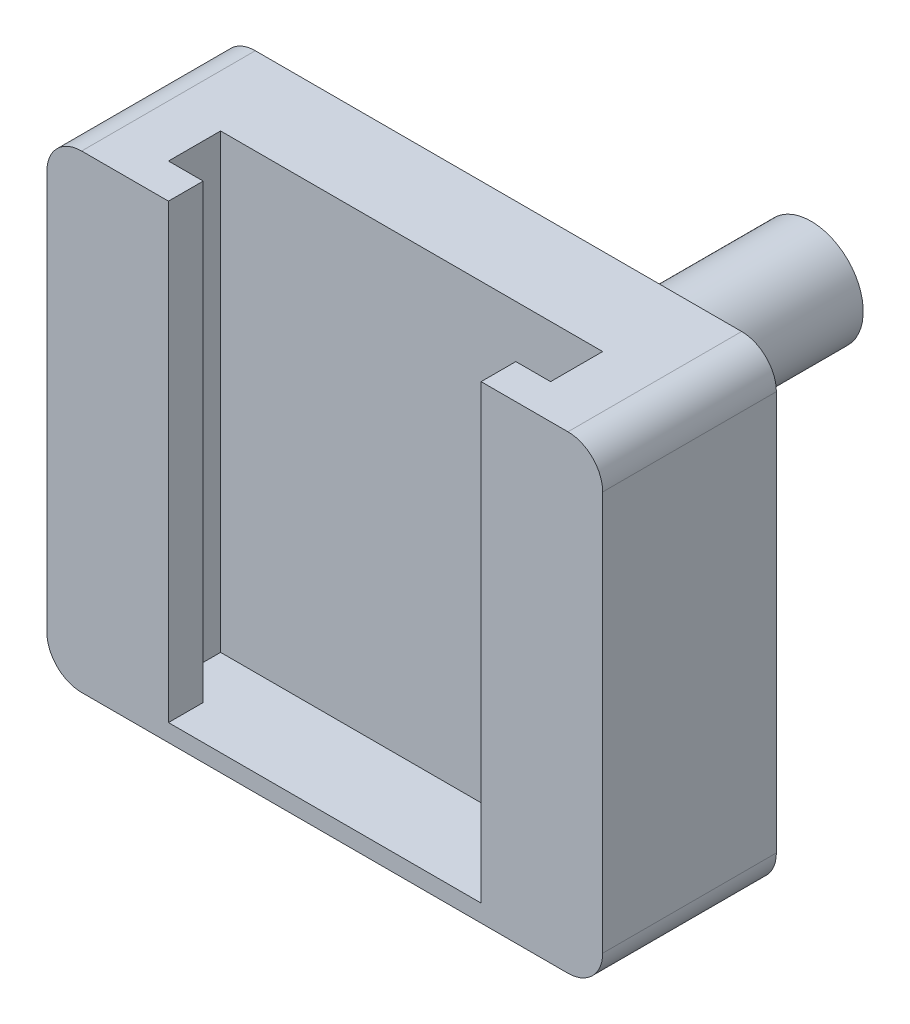
ISO-10303-21;
HEADER;
FILE_DESCRIPTION(('STEP AP214'),'2;1');
FILE_NAME('part.step','',(''),(''),'','','');
FILE_SCHEMA(('AUTOMOTIVE_DESIGN { 1 0 10303 214 1 1 1 1 }'));
ENDSEC;
DATA;
#1=APPLICATION_CONTEXT('core data for automotive mechanical design processes');
#2=APPLICATION_PROTOCOL_DEFINITION('international standard','automotive_design',2000,#1);
#3=PRODUCT_CONTEXT('',#1,'mechanical');
#4=PRODUCT('Part','Part','',(#3));
#5=PRODUCT_RELATED_PRODUCT_CATEGORY('part','',(#4));
#6=PRODUCT_DEFINITION_FORMATION('','',#4);
#7=PRODUCT_DEFINITION_CONTEXT('part definition',#1,'design');
#8=PRODUCT_DEFINITION('design','',#6,#7);
#9=PRODUCT_DEFINITION_SHAPE('','',#8);
#10=(LENGTH_UNIT() NAMED_UNIT(*) SI_UNIT(.MILLI.,.METRE.));
#11=(NAMED_UNIT(*) PLANE_ANGLE_UNIT() SI_UNIT($,.RADIAN.));
#12=(NAMED_UNIT(*) SI_UNIT($,.STERADIAN.) SOLID_ANGLE_UNIT());
#13=UNCERTAINTY_MEASURE_WITH_UNIT(LENGTH_MEASURE(1.E-05),#10,'distance_accuracy_value','');
#14=(GEOMETRIC_REPRESENTATION_CONTEXT(3) GLOBAL_UNCERTAINTY_ASSIGNED_CONTEXT((#13)) GLOBAL_UNIT_ASSIGNED_CONTEXT((#10,
#11,#12)) REPRESENTATION_CONTEXT('',''));
#15=CARTESIAN_POINT('',(0.,0.,0.));
#16=DIRECTION('',(0.,0.,1.));
#17=DIRECTION('',(1.,0.,0.));
#18=AXIS2_PLACEMENT_3D('',#15,#16,#17);
#19=CARTESIAN_POINT('',(0.,0.,10.));
#20=DIRECTION('',(0.,0.,-1.));
#21=DIRECTION('',(-1.,0.,0.));
#22=AXIS2_PLACEMENT_3D('',#19,#20,#21);
#23=PLANE('',#22);
#24=DIRECTION('',(0.,1.,0.));
#25=VECTOR('',#24,1.);
#26=CARTESIAN_POINT('',(9.,-36.061028345357,10.));
#27=LINE('',#26,#25);
#28=CARTESIAN_POINT('',(9.,-12.5000000000001,10.));
#29=VERTEX_POINT('',#28);
#30=CARTESIAN_POINT('',(9.,13.5,10.));
#31=VERTEX_POINT('',#30);
#32=EDGE_CURVE('E159',#29,#31,#27,.T.);
#33=ORIENTED_EDGE('',*,*,#32,.F.);
#34=DIRECTION('',(-1.,0.,0.));
#35=VECTOR('',#34,1.);
#36=CARTESIAN_POINT('',(-9.,-12.5000000000001,10.));
#37=LINE('',#36,#35);
#38=CARTESIAN_POINT('',(-9.,-12.5000000000001,10.));
#39=VERTEX_POINT('',#38);
#40=EDGE_CURVE('E339',#29,#39,#37,.T.);
#41=ORIENTED_EDGE('',*,*,#40,.T.);
#42=DIRECTION('',(0.,1.,0.));
#43=VECTOR('',#42,1.);
#44=CARTESIAN_POINT('',(-9.,-36.061028345357,10.));
#45=LINE('',#44,#43);
#46=CARTESIAN_POINT('',(-9.,13.5,10.));
#47=VERTEX_POINT('',#46);
#48=EDGE_CURVE('E57',#39,#47,#45,.T.);
#49=ORIENTED_EDGE('',*,*,#48,.T.);
#50=DIRECTION('',(1.,0.,0.));
#51=VECTOR('',#50,1.);
#52=CARTESIAN_POINT('',(-15.9999999999999,13.5,10.));
#53=LINE('',#52,#51);
#54=CARTESIAN_POINT('',(-13.9999999999999,13.5,10.));
#55=VERTEX_POINT('',#54);
#56=EDGE_CURVE('E177',#55,#47,#53,.T.);
#57=ORIENTED_EDGE('',*,*,#56,.F.);
#58=CARTESIAN_POINT('',(-13.9999999999999,11.5,10.));
#59=DIRECTION('',(0.,0.,-1.));
#60=DIRECTION('',(-1.,0.,0.));
#61=AXIS2_PLACEMENT_3D('',#58,#59,#60);
#62=CIRCLE('',#61,2.);
#63=CARTESIAN_POINT('',(-15.9999999999999,11.5,10.));
#64=VERTEX_POINT('',#63);
#65=EDGE_CURVE('E221',#55,#64,#62,.F.);
#66=ORIENTED_EDGE('',*,*,#65,.T.);
#67=DIRECTION('',(0.,1.,0.));
#68=VECTOR('',#67,1.);
#69=CARTESIAN_POINT('',(-15.9999999999999,-13.5000000000001,10.));
#70=LINE('',#69,#68);
#71=CARTESIAN_POINT('',(-15.9999999999999,-11.5000000000001,10.));
#72=VERTEX_POINT('',#71);
#73=EDGE_CURVE('E179',#72,#64,#70,.T.);
#74=ORIENTED_EDGE('',*,*,#73,.F.);
#75=CARTESIAN_POINT('',(-13.9999999999999,-11.5000000000001,10.));
#76=DIRECTION('',(0.,0.,-1.));
#77=DIRECTION('',(-1.,0.,0.));
#78=AXIS2_PLACEMENT_3D('',#75,#76,#77);
#79=CIRCLE('',#78,2.);
#80=CARTESIAN_POINT('',(-13.9999999999999,-13.5000000000001,10.));
#81=VERTEX_POINT('',#80);
#82=EDGE_CURVE('E222',#72,#81,#79,.F.);
#83=ORIENTED_EDGE('',*,*,#82,.T.);
#84=DIRECTION('',(1.,0.,0.));
#85=VECTOR('',#84,1.);
#86=CARTESIAN_POINT('',(-15.9999999999999,-13.5000000000001,10.));
#87=LINE('',#86,#85);
#88=CARTESIAN_POINT('',(14.0000000000001,-13.5000000000001,10.));
#89=VERTEX_POINT('',#88);
#90=EDGE_CURVE('E188',#81,#89,#87,.T.);
#91=ORIENTED_EDGE('',*,*,#90,.T.);
#92=CARTESIAN_POINT('',(14.0000000000001,-11.5000000000001,10.));
#93=DIRECTION('',(0.,0.,-1.));
#94=DIRECTION('',(-1.,0.,0.));
#95=AXIS2_PLACEMENT_3D('',#92,#93,#94);
#96=CIRCLE('',#95,2.);
#97=CARTESIAN_POINT('',(16.0000000000001,-11.5000000000001,10.));
#98=VERTEX_POINT('',#97);
#99=EDGE_CURVE('E227',#89,#98,#96,.F.);
#100=ORIENTED_EDGE('',*,*,#99,.T.);
#101=DIRECTION('',(0.,1.,0.));
#102=VECTOR('',#101,1.);
#103=CARTESIAN_POINT('',(16.0000000000001,-13.5000000000001,10.));
#104=LINE('',#103,#102);
#105=CARTESIAN_POINT('',(16.0000000000001,11.5,10.));
#106=VERTEX_POINT('',#105);
#107=EDGE_CURVE('E182',#98,#106,#104,.T.);
#108=ORIENTED_EDGE('',*,*,#107,.T.);
#109=CARTESIAN_POINT('',(14.0000000000001,11.5,10.));
#110=DIRECTION('',(0.,0.,-1.));
#111=DIRECTION('',(-1.,0.,0.));
#112=AXIS2_PLACEMENT_3D('',#109,#110,#111);
#113=CIRCLE('',#112,2.);
#114=CARTESIAN_POINT('',(14.0000000000001,13.5,10.));
#115=VERTEX_POINT('',#114);
#116=EDGE_CURVE('E180',#106,#115,#113,.F.);
#117=ORIENTED_EDGE('',*,*,#116,.T.);
#118=EDGE_CURVE('E63',#31,#115,#53,.T.);
#119=ORIENTED_EDGE('',*,*,#118,.F.);
#120=EDGE_LOOP('',(#33,#41,#49,#57,#66,#74,#83,#91,#100,#108,#117,#119));
#121=FACE_BOUND('',#120,.T.);
#122=ADVANCED_FACE('F41',(#121),#23,.F.);
#123=CARTESIAN_POINT('',(-15.9999999999999,-13.5000000000001,10.));
#124=DIRECTION('',(-1.,0.,0.));
#125=DIRECTION('',(0.,0.,1.));
#126=AXIS2_PLACEMENT_3D('',#123,#124,#125);
#127=PLANE('',#126);
#128=DIRECTION('',(0.,1.,0.));
#129=VECTOR('',#128,1.);
#130=CARTESIAN_POINT('',(-15.9999999999999,-13.5000000000001,0.));
#131=LINE('',#130,#129);
#132=CARTESIAN_POINT('',(-15.9999999999999,-11.5000000000001,0.));
#133=VERTEX_POINT('',#132);
#134=CARTESIAN_POINT('',(-15.9999999999999,11.5,0.));
#135=VERTEX_POINT('',#134);
#136=EDGE_CURVE('E193',#133,#135,#131,.T.);
#137=ORIENTED_EDGE('',*,*,#136,.F.);
#138=DIRECTION('',(0.,0.,-1.));
#139=VECTOR('',#138,1.);
#140=CARTESIAN_POINT('',(-15.9999999999999,-11.5000000000001,10.));
#141=LINE('',#140,#139);
#142=EDGE_CURVE('E235',#133,#72,#141,.F.);
#143=ORIENTED_EDGE('',*,*,#142,.T.);
#144=ORIENTED_EDGE('',*,*,#73,.T.);
#145=DIRECTION('',(0.,0.,-1.));
#146=VECTOR('',#145,1.);
#147=CARTESIAN_POINT('',(-15.9999999999999,11.5,10.));
#148=LINE('',#147,#146);
#149=EDGE_CURVE('E230',#64,#135,#148,.T.);
#150=ORIENTED_EDGE('',*,*,#149,.T.);
#151=EDGE_LOOP('',(#137,#143,#144,#150));
#152=FACE_BOUND('',#151,.T.);
#153=ADVANCED_FACE('F251',(#152),#127,.T.);
#154=CARTESIAN_POINT('',(-15.9999999999999,-13.5000000000001,10.));
#155=DIRECTION('',(0.,1.,0.));
#156=DIRECTION('',(0.,0.,1.));
#157=AXIS2_PLACEMENT_3D('',#154,#155,#156);
#158=PLANE('',#157);
#159=DIRECTION('',(1.,0.,0.));
#160=VECTOR('',#159,1.);
#161=CARTESIAN_POINT('',(-15.9999999999999,-13.5000000000001,0.));
#162=LINE('',#161,#160);
#163=CARTESIAN_POINT('',(-13.9999999999999,-13.5000000000001,0.));
#164=VERTEX_POINT('',#163);
#165=CARTESIAN_POINT('',(14.0000000000001,-13.5000000000001,0.));
#166=VERTEX_POINT('',#165);
#167=EDGE_CURVE('E184',#164,#166,#162,.T.);
#168=ORIENTED_EDGE('',*,*,#167,.T.);
#169=DIRECTION('',(0.,0.,-1.));
#170=VECTOR('',#169,1.);
#171=CARTESIAN_POINT('',(14.0000000000001,-13.5000000000001,10.));
#172=LINE('',#171,#170);
#173=EDGE_CURVE('E217',#166,#89,#172,.F.);
#174=ORIENTED_EDGE('',*,*,#173,.T.);
#175=ORIENTED_EDGE('',*,*,#90,.F.);
#176=DIRECTION('',(0.,0.,-1.));
#177=VECTOR('',#176,1.);
#178=CARTESIAN_POINT('',(-13.9999999999999,-13.5000000000001,0.));
#179=LINE('',#178,#177);
#180=EDGE_CURVE('E216',#81,#164,#179,.T.);
#181=ORIENTED_EDGE('',*,*,#180,.T.);
#182=EDGE_LOOP('',(#168,#174,#175,#181));
#183=FACE_BOUND('',#182,.T.);
#184=ADVANCED_FACE('F264',(#183),#158,.F.);
#185=CARTESIAN_POINT('',(16.0000000000001,-13.5000000000001,10.));
#186=DIRECTION('',(-1.,0.,0.));
#187=DIRECTION('',(0.,0.,1.));
#188=AXIS2_PLACEMENT_3D('',#185,#186,#187);
#189=PLANE('',#188);
#190=ORIENTED_EDGE('',*,*,#107,.F.);
#191=DIRECTION('',(0.,0.,-1.));
#192=VECTOR('',#191,1.);
#193=CARTESIAN_POINT('',(16.0000000000001,-11.5000000000001,10.));
#194=LINE('',#193,#192);
#195=CARTESIAN_POINT('',(16.0000000000001,-11.5000000000001,0.));
#196=VERTEX_POINT('',#195);
#197=EDGE_CURVE('E207',#98,#196,#194,.T.);
#198=ORIENTED_EDGE('',*,*,#197,.T.);
#199=DIRECTION('',(0.,1.,0.));
#200=VECTOR('',#199,1.);
#201=CARTESIAN_POINT('',(16.0000000000001,-13.5000000000001,0.));
#202=LINE('',#201,#200);
#203=CARTESIAN_POINT('',(16.0000000000001,11.5,0.));
#204=VERTEX_POINT('',#203);
#205=EDGE_CURVE('E197',#196,#204,#202,.T.);
#206=ORIENTED_EDGE('',*,*,#205,.T.);
#207=DIRECTION('',(0.,0.,-1.));
#208=VECTOR('',#207,1.);
#209=CARTESIAN_POINT('',(16.0000000000001,11.5,10.));
#210=LINE('',#209,#208);
#211=EDGE_CURVE('E195',#204,#106,#210,.F.);
#212=ORIENTED_EDGE('',*,*,#211,.T.);
#213=EDGE_LOOP('',(#190,#198,#206,#212));
#214=FACE_BOUND('',#213,.T.);
#215=ADVANCED_FACE('F274',(#214),#189,.F.);
#216=CARTESIAN_POINT('',(-15.9999999999999,13.5,10.));
#217=DIRECTION('',(0.,1.,0.));
#218=DIRECTION('',(0.,0.,1.));
#219=AXIS2_PLACEMENT_3D('',#216,#217,#218);
#220=PLANE('',#219);
#221=DIRECTION('',(0.,0.,-1.));
#222=VECTOR('',#221,1.);
#223=CARTESIAN_POINT('',(9.,13.5,8.));
#224=LINE('',#223,#222);
#225=CARTESIAN_POINT('',(9.,13.5,8.));
#226=VERTEX_POINT('',#225);
#227=EDGE_CURVE('E158',#31,#226,#224,.T.);
#228=ORIENTED_EDGE('',*,*,#227,.F.);
#229=ORIENTED_EDGE('',*,*,#118,.T.);
#230=DIRECTION('',(0.,0.,-1.));
#231=VECTOR('',#230,1.);
#232=CARTESIAN_POINT('',(14.0000000000001,13.5,0.));
#233=LINE('',#232,#231);
#234=CARTESIAN_POINT('',(14.0000000000001,13.5,0.));
#235=VERTEX_POINT('',#234);
#236=EDGE_CURVE('E236',#115,#235,#233,.T.);
#237=ORIENTED_EDGE('',*,*,#236,.T.);
#238=DIRECTION('',(1.,0.,0.));
#239=VECTOR('',#238,1.);
#240=CARTESIAN_POINT('',(-15.9999999999999,13.5,0.));
#241=LINE('',#240,#239);
#242=CARTESIAN_POINT('',(-13.9999999999999,13.5,0.));
#243=VERTEX_POINT('',#242);
#244=EDGE_CURVE('E196',#243,#235,#241,.T.);
#245=ORIENTED_EDGE('',*,*,#244,.F.);
#246=DIRECTION('',(0.,0.,-1.));
#247=VECTOR('',#246,1.);
#248=CARTESIAN_POINT('',(-13.9999999999999,13.5,10.));
#249=LINE('',#248,#247);
#250=EDGE_CURVE('E234',#243,#55,#249,.F.);
#251=ORIENTED_EDGE('',*,*,#250,.T.);
#252=ORIENTED_EDGE('',*,*,#56,.T.);
#253=DIRECTION('',(0.,0.,1.));
#254=VECTOR('',#253,1.);
#255=CARTESIAN_POINT('',(-9.,13.5,10.));
#256=LINE('',#255,#254);
#257=CARTESIAN_POINT('',(-9.,13.5,8.));
#258=VERTEX_POINT('',#257);
#259=EDGE_CURVE('E170',#258,#47,#256,.T.);
#260=ORIENTED_EDGE('',*,*,#259,.F.);
#261=DIRECTION('',(1.,0.,0.));
#262=VECTOR('',#261,1.);
#263=CARTESIAN_POINT('',(-9.,13.5,8.));
#264=LINE('',#263,#262);
#265=CARTESIAN_POINT('',(-11.,13.5,8.));
#266=VERTEX_POINT('',#265);
#267=EDGE_CURVE('E324',#266,#258,#264,.T.);
#268=ORIENTED_EDGE('',*,*,#267,.F.);
#269=DIRECTION('',(0.,0.,1.));
#270=VECTOR('',#269,1.);
#271=CARTESIAN_POINT('',(-11.,13.5,8.));
#272=LINE('',#271,#270);
#273=CARTESIAN_POINT('',(-11.,13.5,5.));
#274=VERTEX_POINT('',#273);
#275=EDGE_CURVE('E325',#274,#266,#272,.T.);
#276=ORIENTED_EDGE('',*,*,#275,.F.);
#277=DIRECTION('',(-1.,0.,0.));
#278=VECTOR('',#277,1.);
#279=CARTESIAN_POINT('',(-11.,13.5,5.));
#280=LINE('',#279,#278);
#281=CARTESIAN_POINT('',(11.,13.5,5.));
#282=VERTEX_POINT('',#281);
#283=EDGE_CURVE('E347',#282,#274,#280,.T.);
#284=ORIENTED_EDGE('',*,*,#283,.F.);
#285=DIRECTION('',(0.,0.,-1.));
#286=VECTOR('',#285,1.);
#287=CARTESIAN_POINT('',(11.,13.5,5.));
#288=LINE('',#287,#286);
#289=CARTESIAN_POINT('',(11.,13.5,8.));
#290=VERTEX_POINT('',#289);
#291=EDGE_CURVE('E346',#290,#282,#288,.T.);
#292=ORIENTED_EDGE('',*,*,#291,.F.);
#293=DIRECTION('',(1.,0.,0.));
#294=VECTOR('',#293,1.);
#295=CARTESIAN_POINT('',(11.,13.5,8.));
#296=LINE('',#295,#294);
#297=EDGE_CURVE('E175',#226,#290,#296,.T.);
#298=ORIENTED_EDGE('',*,*,#297,.F.);
#299=EDGE_LOOP('',(#228,#229,#237,#245,#251,#252,#260,#268,#276,#284,#292,#298));
#300=FACE_BOUND('',#299,.T.);
#301=ADVANCED_FACE('F169',(#300),#220,.T.);
#302=CARTESIAN_POINT('',(0.,0.,0.));
#303=DIRECTION('',(0.,0.,-1.));
#304=DIRECTION('',(-1.,0.,0.));
#305=AXIS2_PLACEMENT_3D('',#302,#303,#304);
#306=PLANE('',#305);
#307=CARTESIAN_POINT('',(0.,0.,0.));
#308=DIRECTION('',(0.,0.,-1.));
#309=DIRECTION('',(-1.,0.,0.));
#310=AXIS2_PLACEMENT_3D('',#307,#308,#309);
#311=CIRCLE('',#310,5.);
#312=CARTESIAN_POINT('',(-5.,0.,0.));
#313=VERTEX_POINT('',#312);
#314=EDGE_CURVE('E12',#313,#313,#311,.F.);
#315=ORIENTED_EDGE('',*,*,#314,.T.);
#316=EDGE_LOOP('',(#315));
#317=FACE_BOUND('',#316,.T.);
#318=ORIENTED_EDGE('',*,*,#205,.F.);
#319=CARTESIAN_POINT('',(14.0000000000001,-11.5000000000001,0.));
#320=DIRECTION('',(0.,0.,-1.));
#321=DIRECTION('',(-1.,0.,0.));
#322=AXIS2_PLACEMENT_3D('',#319,#320,#321);
#323=CIRCLE('',#322,2.);
#324=EDGE_CURVE('E212',#196,#166,#323,.T.);
#325=ORIENTED_EDGE('',*,*,#324,.T.);
#326=ORIENTED_EDGE('',*,*,#167,.F.);
#327=CARTESIAN_POINT('',(-13.9999999999999,-11.5000000000001,0.));
#328=DIRECTION('',(0.,0.,-1.));
#329=DIRECTION('',(-1.,0.,0.));
#330=AXIS2_PLACEMENT_3D('',#327,#328,#329);
#331=CIRCLE('',#330,2.);
#332=EDGE_CURVE('E215',#164,#133,#331,.T.);
#333=ORIENTED_EDGE('',*,*,#332,.T.);
#334=ORIENTED_EDGE('',*,*,#136,.T.);
#335=CARTESIAN_POINT('',(-13.9999999999999,11.5,0.));
#336=DIRECTION('',(0.,0.,-1.));
#337=DIRECTION('',(-1.,0.,0.));
#338=AXIS2_PLACEMENT_3D('',#335,#336,#337);
#339=CIRCLE('',#338,2.);
#340=EDGE_CURVE('E209',#135,#243,#339,.T.);
#341=ORIENTED_EDGE('',*,*,#340,.T.);
#342=ORIENTED_EDGE('',*,*,#244,.T.);
#343=CARTESIAN_POINT('',(14.0000000000001,11.5,0.));
#344=DIRECTION('',(0.,0.,-1.));
#345=DIRECTION('',(-1.,0.,0.));
#346=AXIS2_PLACEMENT_3D('',#343,#344,#345);
#347=CIRCLE('',#346,2.);
#348=EDGE_CURVE('E214',#235,#204,#347,.T.);
#349=ORIENTED_EDGE('',*,*,#348,.T.);
#350=EDGE_LOOP('',(#318,#325,#326,#333,#334,#341,#342,#349));
#351=FACE_BOUND('',#350,.T.);
#352=ADVANCED_FACE('F266',(#317,#351),#306,.T.);
#353=CARTESIAN_POINT('',(14.0000000000001,-11.5000000000001,10.));
#354=DIRECTION('',(0.,0.,-1.));
#355=DIRECTION('',(-1.,0.,0.));
#356=AXIS2_PLACEMENT_3D('',#353,#354,#355);
#357=CYLINDRICAL_SURFACE('',#356,2.);
#358=ORIENTED_EDGE('',*,*,#99,.F.);
#359=ORIENTED_EDGE('',*,*,#173,.F.);
#360=ORIENTED_EDGE('',*,*,#324,.F.);
#361=ORIENTED_EDGE('',*,*,#197,.F.);
#362=EDGE_LOOP('',(#358,#359,#360,#361));
#363=FACE_BOUND('',#362,.T.);
#364=ADVANCED_FACE('F267',(#363),#357,.T.);
#365=CARTESIAN_POINT('',(-13.9999999999999,-11.5000000000001,10.));
#366=DIRECTION('',(0.,0.,1.));
#367=DIRECTION('',(1.,0.,0.));
#368=AXIS2_PLACEMENT_3D('',#365,#366,#367);
#369=CYLINDRICAL_SURFACE('',#368,2.);
#370=ORIENTED_EDGE('',*,*,#82,.F.);
#371=ORIENTED_EDGE('',*,*,#142,.F.);
#372=ORIENTED_EDGE('',*,*,#332,.F.);
#373=ORIENTED_EDGE('',*,*,#180,.F.);
#374=EDGE_LOOP('',(#370,#371,#372,#373));
#375=FACE_BOUND('',#374,.T.);
#376=ADVANCED_FACE('F281',(#375),#369,.T.);
#377=CARTESIAN_POINT('',(14.0000000000001,11.5,10.));
#378=DIRECTION('',(0.,0.,1.));
#379=DIRECTION('',(1.,0.,0.));
#380=AXIS2_PLACEMENT_3D('',#377,#378,#379);
#381=CYLINDRICAL_SURFACE('',#380,2.);
#382=ORIENTED_EDGE('',*,*,#116,.F.);
#383=ORIENTED_EDGE('',*,*,#211,.F.);
#384=ORIENTED_EDGE('',*,*,#348,.F.);
#385=ORIENTED_EDGE('',*,*,#236,.F.);
#386=EDGE_LOOP('',(#382,#383,#384,#385));
#387=FACE_BOUND('',#386,.T.);
#388=ADVANCED_FACE('F289',(#387),#381,.T.);
#389=CARTESIAN_POINT('',(-13.9999999999999,11.5,10.));
#390=DIRECTION('',(0.,0.,-1.));
#391=DIRECTION('',(-1.,0.,0.));
#392=AXIS2_PLACEMENT_3D('',#389,#390,#391);
#393=CYLINDRICAL_SURFACE('',#392,2.);
#394=ORIENTED_EDGE('',*,*,#65,.F.);
#395=ORIENTED_EDGE('',*,*,#250,.F.);
#396=ORIENTED_EDGE('',*,*,#340,.F.);
#397=ORIENTED_EDGE('',*,*,#149,.F.);
#398=EDGE_LOOP('',(#394,#395,#396,#397));
#399=FACE_BOUND('',#398,.T.);
#400=ADVANCED_FACE('F288',(#399),#393,.T.);
#401=CARTESIAN_POINT('',(-9.,-36.061028345357,10.));
#402=DIRECTION('',(-1.,0.,0.));
#403=DIRECTION('',(0.,0.,1.));
#404=AXIS2_PLACEMENT_3D('',#401,#402,#403);
#405=PLANE('',#404);
#406=DIRECTION('',(0.,0.,-1.));
#407=VECTOR('',#406,1.);
#408=CARTESIAN_POINT('',(-9.,-12.5000000000001,10.));
#409=LINE('',#408,#407);
#410=CARTESIAN_POINT('',(-9.,-12.5000000000001,8.));
#411=VERTEX_POINT('',#410);
#412=EDGE_CURVE('E338',#39,#411,#409,.T.);
#413=ORIENTED_EDGE('',*,*,#412,.T.);
#414=DIRECTION('',(0.,1.,0.));
#415=VECTOR('',#414,1.);
#416=CARTESIAN_POINT('',(-9.,-36.061028345357,8.));
#417=LINE('',#416,#415);
#418=EDGE_CURVE('E328',#411,#258,#417,.T.);
#419=ORIENTED_EDGE('',*,*,#418,.T.);
#420=ORIENTED_EDGE('',*,*,#259,.T.);
#421=ORIENTED_EDGE('',*,*,#48,.F.);
#422=EDGE_LOOP('',(#413,#419,#420,#421));
#423=FACE_BOUND('',#422,.T.);
#424=ADVANCED_FACE('F293',(#423),#405,.F.);
#425=CARTESIAN_POINT('',(-9.,-36.061028345357,8.));
#426=DIRECTION('',(0.,0.,1.));
#427=DIRECTION('',(1.,0.,0.));
#428=AXIS2_PLACEMENT_3D('',#425,#426,#427);
#429=PLANE('',#428);
#430=DIRECTION('',(-1.,0.,0.));
#431=VECTOR('',#430,1.);
#432=CARTESIAN_POINT('',(-9.,-12.5000000000001,8.));
#433=LINE('',#432,#431);
#434=CARTESIAN_POINT('',(-11.,-12.5000000000001,8.));
#435=VERTEX_POINT('',#434);
#436=EDGE_CURVE('E341',#411,#435,#433,.T.);
#437=ORIENTED_EDGE('',*,*,#436,.T.);
#438=DIRECTION('',(0.,1.,0.));
#439=VECTOR('',#438,1.);
#440=CARTESIAN_POINT('',(-11.,-36.061028345357,8.));
#441=LINE('',#440,#439);
#442=EDGE_CURVE('E334',#435,#266,#441,.T.);
#443=ORIENTED_EDGE('',*,*,#442,.T.);
#444=ORIENTED_EDGE('',*,*,#267,.T.);
#445=ORIENTED_EDGE('',*,*,#418,.F.);
#446=EDGE_LOOP('',(#437,#443,#444,#445));
#447=FACE_BOUND('',#446,.T.);
#448=ADVANCED_FACE('F298',(#447),#429,.F.);
#449=CARTESIAN_POINT('',(-11.,-36.061028345357,8.));
#450=DIRECTION('',(-1.,0.,0.));
#451=DIRECTION('',(0.,0.,1.));
#452=AXIS2_PLACEMENT_3D('',#449,#450,#451);
#453=PLANE('',#452);
#454=DIRECTION('',(0.,0.,-1.));
#455=VECTOR('',#454,1.);
#456=CARTESIAN_POINT('',(-11.,-12.5000000000001,8.));
#457=LINE('',#456,#455);
#458=CARTESIAN_POINT('',(-11.,-12.5000000000001,5.));
#459=VERTEX_POINT('',#458);
#460=EDGE_CURVE('E380',#435,#459,#457,.T.);
#461=ORIENTED_EDGE('',*,*,#460,.T.);
#462=DIRECTION('',(0.,1.,0.));
#463=VECTOR('',#462,1.);
#464=CARTESIAN_POINT('',(-11.,-36.061028345357,5.));
#465=LINE('',#464,#463);
#466=EDGE_CURVE('E335',#459,#274,#465,.T.);
#467=ORIENTED_EDGE('',*,*,#466,.T.);
#468=ORIENTED_EDGE('',*,*,#275,.T.);
#469=ORIENTED_EDGE('',*,*,#442,.F.);
#470=EDGE_LOOP('',(#461,#467,#468,#469));
#471=FACE_BOUND('',#470,.T.);
#472=ADVANCED_FACE('F352',(#471),#453,.F.);
#473=CARTESIAN_POINT('',(-11.,-36.061028345357,5.));
#474=DIRECTION('',(0.,0.,-1.));
#475=DIRECTION('',(-1.,0.,0.));
#476=AXIS2_PLACEMENT_3D('',#473,#474,#475);
#477=PLANE('',#476);
#478=DIRECTION('',(1.,0.,0.));
#479=VECTOR('',#478,1.);
#480=CARTESIAN_POINT('',(-11.,-12.5000000000001,5.));
#481=LINE('',#480,#479);
#482=CARTESIAN_POINT('',(11.,-12.5000000000001,5.));
#483=VERTEX_POINT('',#482);
#484=EDGE_CURVE('E365',#459,#483,#481,.T.);
#485=ORIENTED_EDGE('',*,*,#484,.T.);
#486=DIRECTION('',(0.,1.,0.));
#487=VECTOR('',#486,1.);
#488=CARTESIAN_POINT('',(11.,-36.061028345357,5.));
#489=LINE('',#488,#487);
#490=EDGE_CURVE('E332',#483,#282,#489,.T.);
#491=ORIENTED_EDGE('',*,*,#490,.T.);
#492=ORIENTED_EDGE('',*,*,#283,.T.);
#493=ORIENTED_EDGE('',*,*,#466,.F.);
#494=EDGE_LOOP('',(#485,#491,#492,#493));
#495=FACE_BOUND('',#494,.T.);
#496=ADVANCED_FACE('F360',(#495),#477,.F.);
#497=CARTESIAN_POINT('',(11.,-36.061028345357,5.));
#498=DIRECTION('',(1.,0.,0.));
#499=DIRECTION('',(0.,0.,-1.));
#500=AXIS2_PLACEMENT_3D('',#497,#498,#499);
#501=PLANE('',#500);
#502=DIRECTION('',(0.,0.,1.));
#503=VECTOR('',#502,1.);
#504=CARTESIAN_POINT('',(11.,-12.5000000000001,5.));
#505=LINE('',#504,#503);
#506=CARTESIAN_POINT('',(11.,-12.5000000000001,8.));
#507=VERTEX_POINT('',#506);
#508=EDGE_CURVE('E370',#483,#507,#505,.T.);
#509=ORIENTED_EDGE('',*,*,#508,.T.);
#510=DIRECTION('',(0.,1.,0.));
#511=VECTOR('',#510,1.);
#512=CARTESIAN_POINT('',(11.,-36.061028345357,8.));
#513=LINE('',#512,#511);
#514=EDGE_CURVE('E340',#507,#290,#513,.T.);
#515=ORIENTED_EDGE('',*,*,#514,.T.);
#516=ORIENTED_EDGE('',*,*,#291,.T.);
#517=ORIENTED_EDGE('',*,*,#490,.F.);
#518=EDGE_LOOP('',(#509,#515,#516,#517));
#519=FACE_BOUND('',#518,.T.);
#520=ADVANCED_FACE('F362',(#519),#501,.F.);
#521=CARTESIAN_POINT('',(11.,-36.061028345357,8.));
#522=DIRECTION('',(0.,0.,1.));
#523=DIRECTION('',(1.,0.,0.));
#524=AXIS2_PLACEMENT_3D('',#521,#522,#523);
#525=PLANE('',#524);
#526=DIRECTION('',(-1.,0.,0.));
#527=VECTOR('',#526,1.);
#528=CARTESIAN_POINT('',(11.,-12.5000000000001,8.));
#529=LINE('',#528,#527);
#530=CARTESIAN_POINT('',(9.,-12.5000000000001,8.));
#531=VERTEX_POINT('',#530);
#532=EDGE_CURVE('E330',#507,#531,#529,.T.);
#533=ORIENTED_EDGE('',*,*,#532,.T.);
#534=DIRECTION('',(0.,1.,0.));
#535=VECTOR('',#534,1.);
#536=CARTESIAN_POINT('',(9.,-36.061028345357,8.));
#537=LINE('',#536,#535);
#538=EDGE_CURVE('E168',#531,#226,#537,.T.);
#539=ORIENTED_EDGE('',*,*,#538,.T.);
#540=ORIENTED_EDGE('',*,*,#297,.T.);
#541=ORIENTED_EDGE('',*,*,#514,.F.);
#542=EDGE_LOOP('',(#533,#539,#540,#541));
#543=FACE_BOUND('',#542,.T.);
#544=ADVANCED_FACE('F369',(#543),#525,.F.);
#545=CARTESIAN_POINT('',(9.,-36.061028345357,8.));
#546=DIRECTION('',(1.,0.,0.));
#547=DIRECTION('',(0.,0.,-1.));
#548=AXIS2_PLACEMENT_3D('',#545,#546,#547);
#549=PLANE('',#548);
#550=DIRECTION('',(0.,0.,1.));
#551=VECTOR('',#550,1.);
#552=CARTESIAN_POINT('',(9.,-12.5000000000001,8.));
#553=LINE('',#552,#551);
#554=EDGE_CURVE('E162',#531,#29,#553,.T.);
#555=ORIENTED_EDGE('',*,*,#554,.T.);
#556=ORIENTED_EDGE('',*,*,#32,.T.);
#557=ORIENTED_EDGE('',*,*,#227,.T.);
#558=ORIENTED_EDGE('',*,*,#538,.F.);
#559=EDGE_LOOP('',(#555,#556,#557,#558));
#560=FACE_BOUND('',#559,.T.);
#561=ADVANCED_FACE('F156',(#560),#549,.F.);
#562=CARTESIAN_POINT('',(-15.9999999999999,-12.5000000000001,10.));
#563=DIRECTION('',(0.,1.,0.));
#564=DIRECTION('',(0.,0.,1.));
#565=AXIS2_PLACEMENT_3D('',#562,#563,#564);
#566=PLANE('',#565);
#567=ORIENTED_EDGE('',*,*,#40,.F.);
#568=ORIENTED_EDGE('',*,*,#554,.F.);
#569=ORIENTED_EDGE('',*,*,#532,.F.);
#570=ORIENTED_EDGE('',*,*,#508,.F.);
#571=ORIENTED_EDGE('',*,*,#484,.F.);
#572=ORIENTED_EDGE('',*,*,#460,.F.);
#573=ORIENTED_EDGE('',*,*,#436,.F.);
#574=ORIENTED_EDGE('',*,*,#412,.F.);
#575=EDGE_LOOP('',(#567,#568,#569,#570,#571,#572,#573,#574));
#576=FACE_BOUND('',#575,.T.);
#577=ADVANCED_FACE('F375',(#576),#566,.T.);
#578=CARTESIAN_POINT('',(0.,0.,-18.));
#579=DIRECTION('',(0.,0.,1.));
#580=DIRECTION('',(1.,0.,0.));
#581=AXIS2_PLACEMENT_3D('',#578,#579,#580);
#582=CYLINDRICAL_SURFACE('',#581,3.);
#583=CARTESIAN_POINT('',(0.,0.,-2.));
#584=DIRECTION('',(0.,0.,-1.));
#585=DIRECTION('',(-1.,0.,0.));
#586=AXIS2_PLACEMENT_3D('',#583,#584,#585);
#587=CIRCLE('',#586,3.);
#588=CARTESIAN_POINT('',(-3.,0.,-2.));
#589=VERTEX_POINT('',#588);
#590=EDGE_CURVE('E47',#589,#589,#587,.T.);
#591=ORIENTED_EDGE('',*,*,#590,.T.);
#592=EDGE_LOOP('',(#591));
#593=FACE_BOUND('',#592,.T.);
#594=CARTESIAN_POINT('',(0.,0.,-18.));
#595=DIRECTION('',(0.,0.,-1.));
#596=DIRECTION('',(-1.,0.,0.));
#597=AXIS2_PLACEMENT_3D('',#594,#595,#596);
#598=CIRCLE('',#597,3.);
#599=CARTESIAN_POINT('',(-3.,0.,-18.));
#600=VERTEX_POINT('',#599);
#601=EDGE_CURVE('E173',#600,#600,#598,.T.);
#602=ORIENTED_EDGE('',*,*,#601,.F.);
#603=EDGE_LOOP('',(#602));
#604=FACE_BOUND('',#603,.T.);
#605=ADVANCED_FACE('F239',(#593,#604),#582,.T.);
#606=CARTESIAN_POINT('',(0.,0.,-18.));
#607=DIRECTION('',(0.,0.,-1.));
#608=DIRECTION('',(-1.,0.,0.));
#609=AXIS2_PLACEMENT_3D('',#606,#607,#608);
#610=PLANE('',#609);
#611=ORIENTED_EDGE('',*,*,#601,.T.);
#612=EDGE_LOOP('',(#611));
#613=FACE_BOUND('',#612,.T.);
#614=ADVANCED_FACE('F242',(#613),#610,.T.);
#615=CARTESIAN_POINT('',(0.,0.,-2.));
#616=DIRECTION('',(0.,0.,-1.));
#617=DIRECTION('',(-1.,0.,0.));
#618=AXIS2_PLACEMENT_3D('',#615,#616,#617);
#619=TOROIDAL_SURFACE('',#618,5.,2.);
#620=ORIENTED_EDGE('',*,*,#314,.F.);
#621=EDGE_LOOP('',(#620));
#622=FACE_BOUND('',#621,.T.);
#623=ORIENTED_EDGE('',*,*,#590,.F.);
#624=EDGE_LOOP('',(#623));
#625=FACE_BOUND('',#624,.T.);
#626=ADVANCED_FACE('F43',(#622,#625),#619,.F.);
#627=CLOSED_SHELL('',(#122,#153,#184,#215,#301,#352,#364,#376,#388,#400,#424,#448,#472,#496,
#520,#544,#561,#577,#605,#614,#626));
#628=MANIFOLD_SOLID_BREP('B2',#627);
#629=ADVANCED_BREP_SHAPE_REPRESENTATION('',(#18,#628),#14);
#630=SHAPE_DEFINITION_REPRESENTATION(#9,#629);
ENDSEC;
END-ISO-10303-21;
